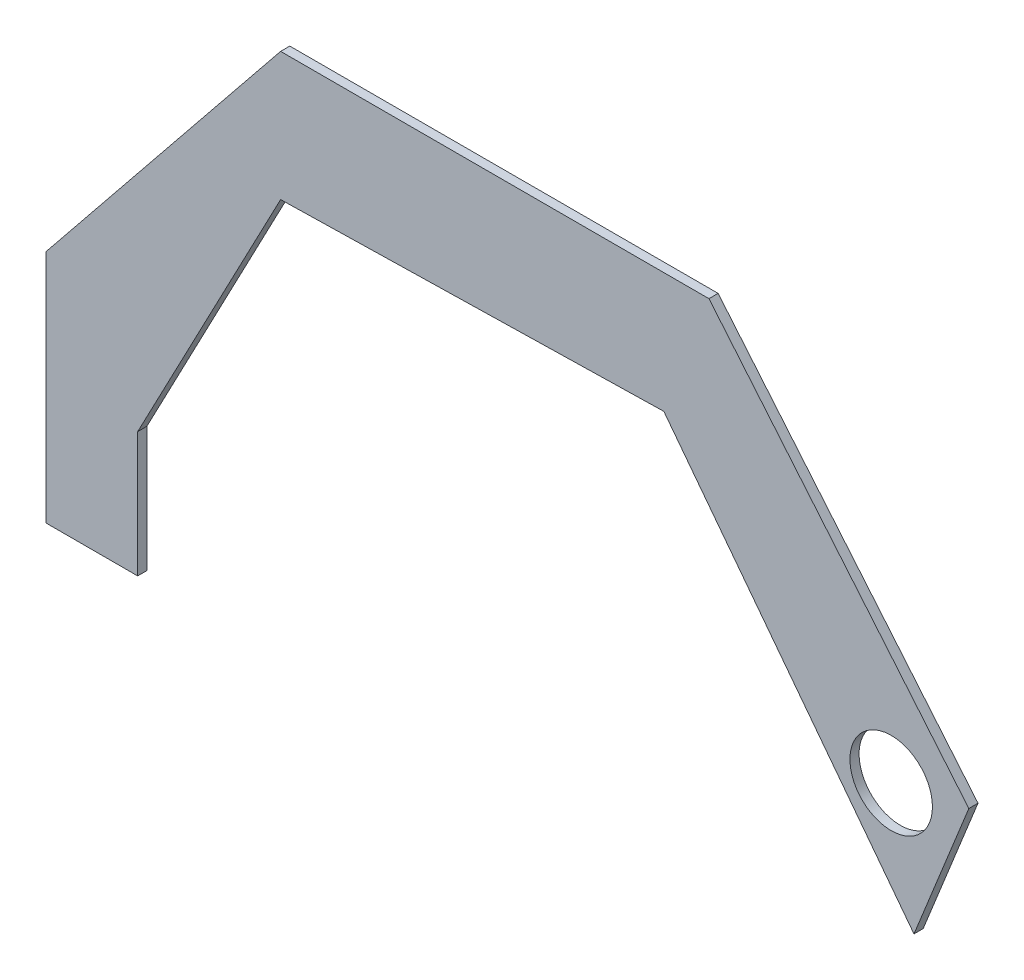
ISO-10303-21;
HEADER;
FILE_DESCRIPTION(('STEP AP214'),'2;1');
FILE_NAME('part.step','',(''),(''),'','','');
FILE_SCHEMA(('AUTOMOTIVE_DESIGN { 1 0 10303 214 1 1 1 1 }'));
ENDSEC;
DATA;
#1=APPLICATION_CONTEXT('core data for automotive mechanical design processes');
#2=APPLICATION_PROTOCOL_DEFINITION('international standard','automotive_design',2000,#1);
#3=PRODUCT_CONTEXT('',#1,'mechanical');
#4=PRODUCT('Part','Part','',(#3));
#5=PRODUCT_RELATED_PRODUCT_CATEGORY('part','',(#4));
#6=PRODUCT_DEFINITION_FORMATION('','',#4);
#7=PRODUCT_DEFINITION_CONTEXT('part definition',#1,'design');
#8=PRODUCT_DEFINITION('design','',#6,#7);
#9=PRODUCT_DEFINITION_SHAPE('','',#8);
#10=(LENGTH_UNIT() NAMED_UNIT(*) SI_UNIT(.MILLI.,.METRE.));
#11=(NAMED_UNIT(*) PLANE_ANGLE_UNIT() SI_UNIT($,.RADIAN.));
#12=(NAMED_UNIT(*) SI_UNIT($,.STERADIAN.) SOLID_ANGLE_UNIT());
#13=UNCERTAINTY_MEASURE_WITH_UNIT(LENGTH_MEASURE(1.E-05),#10,'distance_accuracy_value','');
#14=(GEOMETRIC_REPRESENTATION_CONTEXT(3) GLOBAL_UNCERTAINTY_ASSIGNED_CONTEXT((#13)) GLOBAL_UNIT_ASSIGNED_CONTEXT((#10,
#11,#12)) REPRESENTATION_CONTEXT('',''));
#15=CARTESIAN_POINT('',(0.,0.,0.));
#16=DIRECTION('',(0.,0.,1.));
#17=DIRECTION('',(1.,0.,0.));
#18=AXIS2_PLACEMENT_3D('',#15,#16,#17);
#19=CARTESIAN_POINT('',(-203.510882617546,0.,3.175));
#20=DIRECTION('',(-1.,0.,0.));
#21=DIRECTION('',(0.,0.,1.));
#22=AXIS2_PLACEMENT_3D('',#19,#20,#21);
#23=PLANE('',#22);
#24=DIRECTION('',(0.,1.,0.));
#25=VECTOR('',#24,1.);
#26=CARTESIAN_POINT('',(-203.510882617546,0.,0.));
#27=LINE('',#26,#25);
#28=CARTESIAN_POINT('',(-203.510882617546,-30.8755089620444,0.));
#29=VERTEX_POINT('',#28);
#30=CARTESIAN_POINT('',(-203.510882617546,12.4104778327751,0.));
#31=VERTEX_POINT('',#30);
#32=EDGE_CURVE('E154',#29,#31,#27,.T.);
#33=ORIENTED_EDGE('',*,*,#32,.T.);
#34=DIRECTION('',(0.,0.,-1.));
#35=VECTOR('',#34,1.);
#36=CARTESIAN_POINT('',(-203.510882617546,12.4104778327751,3.175));
#37=LINE('',#36,#35);
#38=CARTESIAN_POINT('',(-203.510882617546,12.4104778327751,3.175));
#39=VERTEX_POINT('',#38);
#40=EDGE_CURVE('E11',#39,#31,#37,.T.);
#41=ORIENTED_EDGE('',*,*,#40,.F.);
#42=DIRECTION('',(0.,1.,0.));
#43=VECTOR('',#42,1.);
#44=CARTESIAN_POINT('',(-203.510882617546,0.,3.175));
#45=LINE('',#44,#43);
#46=CARTESIAN_POINT('',(-203.510882617546,-30.8755089620444,3.175));
#47=VERTEX_POINT('',#46);
#48=EDGE_CURVE('E187',#47,#39,#45,.T.);
#49=ORIENTED_EDGE('',*,*,#48,.F.);
#50=DIRECTION('',(0.,0.,-1.));
#51=VECTOR('',#50,1.);
#52=CARTESIAN_POINT('',(-203.510882617546,-30.8755089620444,3.175));
#53=LINE('',#52,#51);
#54=EDGE_CURVE('E150',#47,#29,#53,.T.);
#55=ORIENTED_EDGE('',*,*,#54,.T.);
#56=EDGE_LOOP('',(#33,#41,#49,#55));
#57=FACE_BOUND('',#56,.T.);
#58=ADVANCED_FACE('F41',(#57),#23,.F.);
#59=CARTESIAN_POINT('',(-164.687205264938,86.4066597973056,3.175));
#60=DIRECTION('',(-0.885517645428253,0.464605746450905,0.));
#61=DIRECTION('',(-0.464605746450905,-0.885517645428253,0.));
#62=AXIS2_PLACEMENT_3D('',#59,#60,#61);
#63=PLANE('',#62);
#64=DIRECTION('',(0.464605746450905,0.885517645428253,0.));
#65=VECTOR('',#64,1.);
#66=CARTESIAN_POINT('',(-164.687205264938,86.4066597973056,0.));
#67=LINE('',#66,#65);
#68=CARTESIAN_POINT('',(-154.009419924439,106.758038154841,0.));
#69=VERTEX_POINT('',#68);
#70=EDGE_CURVE('E158',#31,#69,#67,.T.);
#71=ORIENTED_EDGE('',*,*,#70,.T.);
#72=DIRECTION('',(0.,0.,-1.));
#73=VECTOR('',#72,1.);
#74=CARTESIAN_POINT('',(-154.009419924439,106.758038154841,3.175));
#75=LINE('',#74,#73);
#76=CARTESIAN_POINT('',(-154.009419924439,106.758038154841,3.175));
#77=VERTEX_POINT('',#76);
#78=EDGE_CURVE('E50',#77,#69,#75,.T.);
#79=ORIENTED_EDGE('',*,*,#78,.F.);
#80=DIRECTION('',(0.464605746450905,0.885517645428253,0.));
#81=VECTOR('',#80,1.);
#82=CARTESIAN_POINT('',(-164.687205264938,86.4066597973056,3.175));
#83=LINE('',#82,#81);
#84=EDGE_CURVE('E107',#39,#77,#83,.T.);
#85=ORIENTED_EDGE('',*,*,#84,.F.);
#86=ORIENTED_EDGE('',*,*,#40,.T.);
#87=EDGE_LOOP('',(#71,#79,#85,#86));
#88=FACE_BOUND('',#87,.T.);
#89=ADVANCED_FACE('F213',(#88),#63,.F.);
#90=CARTESIAN_POINT('',(-2.34777931742708,109.995162894638,3.175));
#91=DIRECTION('',(0.0213395265239197,-0.99977228637712,0.));
#92=DIRECTION('',(0.99977228637712,0.0213395265239197,0.));
#93=AXIS2_PLACEMENT_3D('',#90,#91,#92);
#94=PLANE('',#93);
#95=DIRECTION('',(-0.99977228637712,-0.0213395265239197,0.));
#96=VECTOR('',#95,1.);
#97=CARTESIAN_POINT('',(-2.34777931742708,109.995162894638,0.));
#98=LINE('',#97,#96);
#99=CARTESIAN_POINT('',(-21.2833240350694,109.590995301424,0.));
#100=VERTEX_POINT('',#99);
#101=EDGE_CURVE('E163',#100,#69,#98,.T.);
#102=ORIENTED_EDGE('',*,*,#101,.F.);
#103=DIRECTION('',(0.,0.,-1.));
#104=VECTOR('',#103,1.);
#105=CARTESIAN_POINT('',(-21.2833240350694,109.590995301424,3.175));
#106=LINE('',#105,#104);
#107=CARTESIAN_POINT('',(-21.2833240350694,109.590995301424,3.175));
#108=VERTEX_POINT('',#107);
#109=EDGE_CURVE('E204',#108,#100,#106,.T.);
#110=ORIENTED_EDGE('',*,*,#109,.F.);
#111=DIRECTION('',(-0.99977228637712,-0.0213395265239197,0.));
#112=VECTOR('',#111,1.);
#113=CARTESIAN_POINT('',(-2.34777931742708,109.995162894638,3.175));
#114=LINE('',#113,#112);
#115=EDGE_CURVE('E212',#108,#77,#114,.T.);
#116=ORIENTED_EDGE('',*,*,#115,.T.);
#117=ORIENTED_EDGE('',*,*,#78,.T.);
#118=EDGE_LOOP('',(#102,#110,#116,#117));
#119=FACE_BOUND('',#118,.T.);
#120=ADVANCED_FACE('F210',(#119),#94,.T.);
#121=CARTESIAN_POINT('',(39.4211148047819,30.1072431534103,3.175));
#122=DIRECTION('',(-0.794730408957945,-0.606962582930396,0.));
#123=DIRECTION('',(0.606962582930396,-0.794730408957945,0.));
#124=AXIS2_PLACEMENT_3D('',#121,#122,#123);
#125=PLANE('',#124);
#126=DIRECTION('',(-0.606962582930396,0.794730408957945,0.));
#127=VECTOR('',#126,1.);
#128=CARTESIAN_POINT('',(39.4211148047819,30.1072431534103,0.));
#129=LINE('',#128,#127);
#130=CARTESIAN_POINT('',(65.3338739987104,-3.82179677520289,0.));
#131=VERTEX_POINT('',#130);
#132=EDGE_CURVE('E167',#131,#100,#129,.T.);
#133=ORIENTED_EDGE('',*,*,#132,.F.);
#134=DIRECTION('',(0.,0.,-1.));
#135=VECTOR('',#134,1.);
#136=CARTESIAN_POINT('',(65.3338739987104,-3.82179677520289,3.175));
#137=LINE('',#136,#135);
#138=CARTESIAN_POINT('',(65.3338739987104,-3.82179677520289,3.175));
#139=VERTEX_POINT('',#138);
#140=EDGE_CURVE('E201',#139,#131,#137,.T.);
#141=ORIENTED_EDGE('',*,*,#140,.F.);
#142=DIRECTION('',(-0.606962582930396,0.794730408957945,0.));
#143=VECTOR('',#142,1.);
#144=CARTESIAN_POINT('',(39.4211148047819,30.1072431534103,3.175));
#145=LINE('',#144,#143);
#146=EDGE_CURVE('E225',#139,#108,#145,.T.);
#147=ORIENTED_EDGE('',*,*,#146,.T.);
#148=ORIENTED_EDGE('',*,*,#109,.T.);
#149=EDGE_LOOP('',(#133,#141,#147,#148));
#150=FACE_BOUND('',#149,.T.);
#151=ADVANCED_FACE('F222',(#150),#125,.T.);
#152=CARTESIAN_POINT('',(57.5262896283198,-23.1898291040724,3.175));
#153=DIRECTION('',(0.927476447554903,-0.37388158450362,0.));
#154=DIRECTION('',(0.37388158450362,0.927476447554903,0.));
#155=AXIS2_PLACEMENT_3D('',#152,#153,#154);
#156=PLANE('',#155);
#157=DIRECTION('',(-0.37388158450362,-0.927476447554903,0.));
#158=VECTOR('',#157,1.);
#159=CARTESIAN_POINT('',(57.5262896283198,-23.1898291040724,0.));
#160=LINE('',#159,#158);
#161=CARTESIAN_POINT('',(84.3270584914944,43.2940067605862,0.));
#162=VERTEX_POINT('',#161);
#163=EDGE_CURVE('E171',#162,#131,#160,.T.);
#164=ORIENTED_EDGE('',*,*,#163,.F.);
#165=DIRECTION('',(0.,0.,-1.));
#166=VECTOR('',#165,1.);
#167=CARTESIAN_POINT('',(84.3270584914944,43.2940067605862,3.175));
#168=LINE('',#167,#166);
#169=CARTESIAN_POINT('',(84.3270584914944,43.2940067605862,3.175));
#170=VERTEX_POINT('',#169);
#171=EDGE_CURVE('E198',#170,#162,#168,.T.);
#172=ORIENTED_EDGE('',*,*,#171,.F.);
#173=DIRECTION('',(-0.37388158450362,-0.927476447554903,0.));
#174=VECTOR('',#173,1.);
#175=CARTESIAN_POINT('',(57.5262896283198,-23.1898291040724,3.175));
#176=LINE('',#175,#174);
#177=EDGE_CURVE('E232',#170,#139,#176,.T.);
#178=ORIENTED_EDGE('',*,*,#177,.T.);
#179=ORIENTED_EDGE('',*,*,#140,.T.);
#180=EDGE_LOOP('',(#164,#172,#178,#179));
#181=FACE_BOUND('',#180,.T.);
#182=ADVANCED_FACE('F273',(#181),#156,.T.);
#183=CARTESIAN_POINT('',(71.0313306191042,59.2369754163535,3.175));
#184=DIRECTION('',(-0.767986201682085,-0.640466387897072,0.));
#185=DIRECTION('',(0.640466387897072,-0.767986201682086,0.));
#186=AXIS2_PLACEMENT_3D('',#183,#184,#185);
#187=PLANE('',#186);
#188=DIRECTION('',(-0.640466387897072,0.767986201682086,0.));
#189=VECTOR('',#188,1.);
#190=CARTESIAN_POINT('',(71.0313306191042,59.2369754163535,0.));
#191=LINE('',#190,#189);
#192=CARTESIAN_POINT('',(-5.66845150479128,151.208038154841,0.));
#193=VERTEX_POINT('',#192);
#194=EDGE_CURVE('E175',#162,#193,#191,.T.);
#195=ORIENTED_EDGE('',*,*,#194,.T.);
#196=DIRECTION('',(0.,0.,-1.));
#197=VECTOR('',#196,1.);
#198=CARTESIAN_POINT('',(-5.66845150479128,151.208038154841,3.175));
#199=LINE('',#198,#197);
#200=CARTESIAN_POINT('',(-5.66845150479128,151.208038154841,3.175));
#201=VERTEX_POINT('',#200);
#202=EDGE_CURVE('E194',#201,#193,#199,.T.);
#203=ORIENTED_EDGE('',*,*,#202,.F.);
#204=DIRECTION('',(-0.640466387897072,0.767986201682086,0.));
#205=VECTOR('',#204,1.);
#206=CARTESIAN_POINT('',(71.0313306191042,59.2369754163535,3.175));
#207=LINE('',#206,#205);
#208=EDGE_CURVE('E239',#170,#201,#207,.T.);
#209=ORIENTED_EDGE('',*,*,#208,.F.);
#210=ORIENTED_EDGE('',*,*,#171,.T.);
#211=EDGE_LOOP('',(#195,#203,#209,#210));
#212=FACE_BOUND('',#211,.T.);
#213=ADVANCED_FACE('F245',(#212),#187,.F.);
#214=CARTESIAN_POINT('',(0.,151.208038154841,3.175));
#215=DIRECTION('',(0.,-1.,0.));
#216=DIRECTION('',(1.,0.,0.));
#217=AXIS2_PLACEMENT_3D('',#214,#215,#216);
#218=PLANE('',#217);
#219=DIRECTION('',(-1.,0.,0.));
#220=VECTOR('',#219,1.);
#221=CARTESIAN_POINT('',(0.,151.208038154841,0.));
#222=LINE('',#221,#220);
#223=CARTESIAN_POINT('',(-154.009419924439,151.208038154841,0.));
#224=VERTEX_POINT('',#223);
#225=EDGE_CURVE('E178',#193,#224,#222,.T.);
#226=ORIENTED_EDGE('',*,*,#225,.T.);
#227=DIRECTION('',(0.,0.,-1.));
#228=VECTOR('',#227,1.);
#229=CARTESIAN_POINT('',(-154.009419924439,151.208038154841,3.175));
#230=LINE('',#229,#228);
#231=CARTESIAN_POINT('',(-154.009419924439,151.208038154841,3.175));
#232=VERTEX_POINT('',#231);
#233=EDGE_CURVE('E143',#232,#224,#230,.T.);
#234=ORIENTED_EDGE('',*,*,#233,.F.);
#235=DIRECTION('',(-1.,0.,0.));
#236=VECTOR('',#235,1.);
#237=CARTESIAN_POINT('',(0.,151.208038154841,3.175));
#238=LINE('',#237,#236);
#239=EDGE_CURVE('E132',#201,#232,#238,.T.);
#240=ORIENTED_EDGE('',*,*,#239,.F.);
#241=ORIENTED_EDGE('',*,*,#202,.T.);
#242=EDGE_LOOP('',(#226,#234,#240,#241));
#243=FACE_BOUND('',#242,.T.);
#244=ADVANCED_FACE('F248',(#243),#218,.F.);
#245=CARTESIAN_POINT('',(-167.175158557406,134.891313307865,3.175));
#246=DIRECTION('',(0.778247777194334,-0.627957321234555,0.));
#247=DIRECTION('',(0.627957321234555,0.778247777194335,0.));
#248=AXIS2_PLACEMENT_3D('',#245,#246,#247);
#249=PLANE('',#248);
#250=DIRECTION('',(-0.627957321234555,-0.778247777194334,0.));
#251=VECTOR('',#250,1.);
#252=CARTESIAN_POINT('',(-167.175158557406,134.891313307865,0.));
#253=LINE('',#252,#251);
#254=CARTESIAN_POINT('',(-235.260882617546,50.5104778327751,0.));
#255=VERTEX_POINT('',#254);
#256=EDGE_CURVE('E141',#224,#255,#253,.T.);
#257=ORIENTED_EDGE('',*,*,#256,.T.);
#258=DIRECTION('',(0.,0.,-1.));
#259=VECTOR('',#258,1.);
#260=CARTESIAN_POINT('',(-235.260882617546,50.5104778327751,3.175));
#261=LINE('',#260,#259);
#262=CARTESIAN_POINT('',(-235.260882617546,50.5104778327751,3.175));
#263=VERTEX_POINT('',#262);
#264=EDGE_CURVE('E138',#263,#255,#261,.T.);
#265=ORIENTED_EDGE('',*,*,#264,.F.);
#266=DIRECTION('',(-0.627957321234555,-0.778247777194334,0.));
#267=VECTOR('',#266,1.);
#268=CARTESIAN_POINT('',(-167.175158557406,134.891313307865,3.175));
#269=LINE('',#268,#267);
#270=EDGE_CURVE('E126',#232,#263,#269,.T.);
#271=ORIENTED_EDGE('',*,*,#270,.F.);
#272=ORIENTED_EDGE('',*,*,#233,.T.);
#273=EDGE_LOOP('',(#257,#265,#271,#272));
#274=FACE_BOUND('',#273,.T.);
#275=ADVANCED_FACE('F139',(#274),#249,.F.);
#276=CARTESIAN_POINT('',(-235.260882617546,0.,3.175));
#277=DIRECTION('',(1.,0.,0.));
#278=DIRECTION('',(0.,0.,-1.));
#279=AXIS2_PLACEMENT_3D('',#276,#277,#278);
#280=PLANE('',#279);
#281=DIRECTION('',(0.,-1.,0.));
#282=VECTOR('',#281,1.);
#283=CARTESIAN_POINT('',(-235.260882617546,0.,0.));
#284=LINE('',#283,#282);
#285=CARTESIAN_POINT('',(-235.260882617546,-30.8755089620444,0.));
#286=VERTEX_POINT('',#285);
#287=EDGE_CURVE('E93',#255,#286,#284,.T.);
#288=ORIENTED_EDGE('',*,*,#287,.T.);
#289=DIRECTION('',(0.,0.,-1.));
#290=VECTOR('',#289,1.);
#291=CARTESIAN_POINT('',(-235.260882617546,-30.8755089620444,3.175));
#292=LINE('',#291,#290);
#293=CARTESIAN_POINT('',(-235.260882617546,-30.8755089620444,3.175));
#294=VERTEX_POINT('',#293);
#295=EDGE_CURVE('E144',#294,#286,#292,.T.);
#296=ORIENTED_EDGE('',*,*,#295,.F.);
#297=DIRECTION('',(0.,-1.,0.));
#298=VECTOR('',#297,1.);
#299=CARTESIAN_POINT('',(-235.260882617546,0.,3.175));
#300=LINE('',#299,#298);
#301=EDGE_CURVE('E130',#263,#294,#300,.T.);
#302=ORIENTED_EDGE('',*,*,#301,.F.);
#303=ORIENTED_EDGE('',*,*,#264,.T.);
#304=EDGE_LOOP('',(#288,#296,#302,#303));
#305=FACE_BOUND('',#304,.T.);
#306=ADVANCED_FACE('F146',(#305),#280,.F.);
#307=CARTESIAN_POINT('',(0.,-30.8755089620444,3.175));
#308=DIRECTION('',(0.,1.,0.));
#309=DIRECTION('',(0.,0.,1.));
#310=AXIS2_PLACEMENT_3D('',#307,#308,#309);
#311=PLANE('',#310);
#312=DIRECTION('',(1.,0.,0.));
#313=VECTOR('',#312,1.);
#314=CARTESIAN_POINT('',(0.,-30.8755089620444,0.));
#315=LINE('',#314,#313);
#316=EDGE_CURVE('E99',#286,#29,#315,.T.);
#317=ORIENTED_EDGE('',*,*,#316,.T.);
#318=ORIENTED_EDGE('',*,*,#54,.F.);
#319=DIRECTION('',(1.,0.,0.));
#320=VECTOR('',#319,1.);
#321=CARTESIAN_POINT('',(0.,-30.8755089620444,3.175));
#322=LINE('',#321,#320);
#323=EDGE_CURVE('E58',#294,#47,#322,.T.);
#324=ORIENTED_EDGE('',*,*,#323,.F.);
#325=ORIENTED_EDGE('',*,*,#295,.T.);
#326=EDGE_LOOP('',(#317,#318,#324,#325));
#327=FACE_BOUND('',#326,.T.);
#328=ADVANCED_FACE('F251',(#327),#311,.F.);
#329=CARTESIAN_POINT('',(0.,0.,3.175));
#330=DIRECTION('',(0.,0.,1.));
#331=DIRECTION('',(1.,0.,0.));
#332=AXIS2_PLACEMENT_3D('',#329,#330,#331);
#333=PLANE('',#332);
#334=CARTESIAN_POINT('',(57.4325048245526,37.4971488318392,3.175));
#335=DIRECTION('',(0.,0.,1.));
#336=DIRECTION('',(1.,0.,0.));
#337=AXIS2_PLACEMENT_3D('',#334,#335,#336);
#338=CIRCLE('',#337,14.2875);
#339=CARTESIAN_POINT('',(71.7200048245526,37.4971488318392,3.175));
#340=VERTEX_POINT('',#339);
#341=EDGE_CURVE('E331',#340,#340,#338,.T.);
#342=ORIENTED_EDGE('',*,*,#341,.F.);
#343=EDGE_LOOP('',(#342));
#344=FACE_BOUND('',#343,.T.);
#345=ORIENTED_EDGE('',*,*,#48,.T.);
#346=ORIENTED_EDGE('',*,*,#84,.T.);
#347=ORIENTED_EDGE('',*,*,#115,.F.);
#348=ORIENTED_EDGE('',*,*,#146,.F.);
#349=ORIENTED_EDGE('',*,*,#177,.F.);
#350=ORIENTED_EDGE('',*,*,#208,.T.);
#351=ORIENTED_EDGE('',*,*,#239,.T.);
#352=ORIENTED_EDGE('',*,*,#270,.T.);
#353=ORIENTED_EDGE('',*,*,#301,.T.);
#354=ORIENTED_EDGE('',*,*,#323,.T.);
#355=EDGE_LOOP('',(#345,#346,#347,#348,#349,#350,#351,#352,#353,#354));
#356=FACE_BOUND('',#355,.T.);
#357=ADVANCED_FACE('F128',(#344,#356),#333,.T.);
#358=CARTESIAN_POINT('',(0.,0.,0.));
#359=DIRECTION('',(0.,0.,1.));
#360=DIRECTION('',(1.,0.,0.));
#361=AXIS2_PLACEMENT_3D('',#358,#359,#360);
#362=PLANE('',#361);
#363=CARTESIAN_POINT('',(57.4325048245526,37.4971488318392,0.));
#364=DIRECTION('',(0.,0.,1.));
#365=DIRECTION('',(1.,0.,0.));
#366=AXIS2_PLACEMENT_3D('',#363,#364,#365);
#367=CIRCLE('',#366,14.2875);
#368=CARTESIAN_POINT('',(71.7200048245526,37.4971488318392,0.));
#369=VERTEX_POINT('',#368);
#370=EDGE_CURVE('E159',#369,#369,#367,.T.);
#371=ORIENTED_EDGE('',*,*,#370,.T.);
#372=EDGE_LOOP('',(#371));
#373=FACE_BOUND('',#372,.T.);
#374=ORIENTED_EDGE('',*,*,#32,.F.);
#375=ORIENTED_EDGE('',*,*,#316,.F.);
#376=ORIENTED_EDGE('',*,*,#287,.F.);
#377=ORIENTED_EDGE('',*,*,#256,.F.);
#378=ORIENTED_EDGE('',*,*,#225,.F.);
#379=ORIENTED_EDGE('',*,*,#194,.F.);
#380=ORIENTED_EDGE('',*,*,#163,.T.);
#381=ORIENTED_EDGE('',*,*,#132,.T.);
#382=ORIENTED_EDGE('',*,*,#101,.T.);
#383=ORIENTED_EDGE('',*,*,#70,.F.);
#384=EDGE_LOOP('',(#374,#375,#376,#377,#378,#379,#380,#381,#382,#383));
#385=FACE_BOUND('',#384,.T.);
#386=ADVANCED_FACE('F217',(#373,#385),#362,.F.);
#387=CARTESIAN_POINT('',(57.4325048245526,37.4971488318392,0.));
#388=DIRECTION('',(0.,0.,1.));
#389=DIRECTION('',(1.,0.,0.));
#390=AXIS2_PLACEMENT_3D('',#387,#388,#389);
#391=CYLINDRICAL_SURFACE('',#390,14.2875);
#392=ORIENTED_EDGE('',*,*,#370,.F.);
#393=EDGE_LOOP('',(#392));
#394=FACE_BOUND('',#393,.T.);
#395=ORIENTED_EDGE('',*,*,#341,.T.);
#396=EDGE_LOOP('',(#395));
#397=FACE_BOUND('',#396,.T.);
#398=ADVANCED_FACE('F312',(#394,#397),#391,.F.);
#399=CLOSED_SHELL('',(#58,#89,#120,#151,#182,#213,#244,#275,#306,#328,#357,#386,#398));
#400=MANIFOLD_SOLID_BREP('B2',#399);
#401=ADVANCED_BREP_SHAPE_REPRESENTATION('',(#18,#400),#14);
#402=SHAPE_DEFINITION_REPRESENTATION(#9,#401);
ENDSEC;
END-ISO-10303-21;
